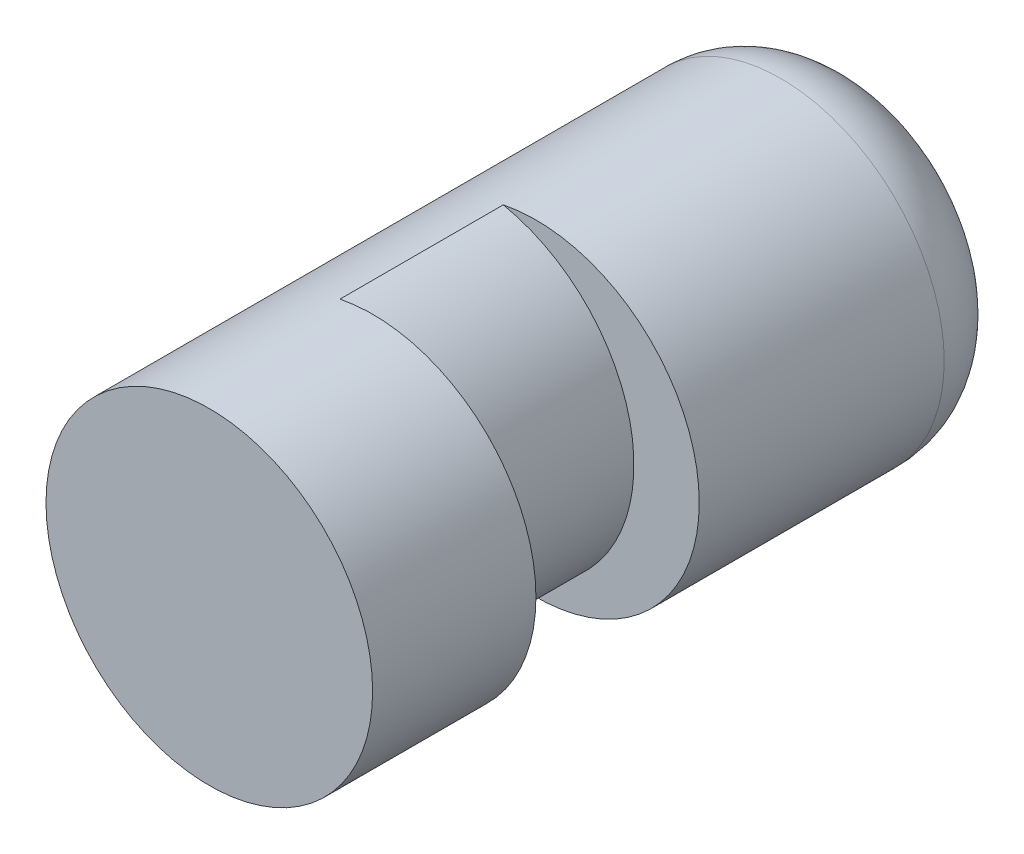
ISO-10303-21;
HEADER;
FILE_DESCRIPTION(('STEP AP214'),'2;1');
FILE_NAME('part.step','',(''),(''),'','','');
FILE_SCHEMA(('AUTOMOTIVE_DESIGN { 1 0 10303 214 1 1 1 1 }'));
ENDSEC;
DATA;
#1=APPLICATION_CONTEXT('core data for automotive mechanical design processes');
#2=APPLICATION_PROTOCOL_DEFINITION('international standard','automotive_design',2000,#1);
#3=PRODUCT_CONTEXT('',#1,'mechanical');
#4=PRODUCT('Part','Part','',(#3));
#5=PRODUCT_RELATED_PRODUCT_CATEGORY('part','',(#4));
#6=PRODUCT_DEFINITION_FORMATION('','',#4);
#7=PRODUCT_DEFINITION_CONTEXT('part definition',#1,'design');
#8=PRODUCT_DEFINITION('design','',#6,#7);
#9=PRODUCT_DEFINITION_SHAPE('','',#8);
#10=(LENGTH_UNIT() NAMED_UNIT(*) SI_UNIT(.MILLI.,.METRE.));
#11=(NAMED_UNIT(*) PLANE_ANGLE_UNIT() SI_UNIT($,.RADIAN.));
#12=(NAMED_UNIT(*) SI_UNIT($,.STERADIAN.) SOLID_ANGLE_UNIT());
#13=UNCERTAINTY_MEASURE_WITH_UNIT(LENGTH_MEASURE(1.E-05),#10,'distance_accuracy_value','');
#14=(GEOMETRIC_REPRESENTATION_CONTEXT(3) GLOBAL_UNCERTAINTY_ASSIGNED_CONTEXT((#13)) GLOBAL_UNIT_ASSIGNED_CONTEXT((#10,
#11,#12)) REPRESENTATION_CONTEXT('',''));
#15=CARTESIAN_POINT('',(0.,0.,0.));
#16=DIRECTION('',(0.,0.,1.));
#17=DIRECTION('',(1.,0.,0.));
#18=AXIS2_PLACEMENT_3D('',#15,#16,#17);
#19=CARTESIAN_POINT('',(-109.908874461109,962.175000000001,-25.4));
#20=DIRECTION('',(0.,0.,1.));
#21=DIRECTION('',(1.,0.,0.));
#22=AXIS2_PLACEMENT_3D('',#19,#20,#21);
#23=CYLINDRICAL_SURFACE('',#22,6.35000000000006);
#24=CARTESIAN_POINT('',(-109.908874461109,962.175000000001,-22.225));
#25=DIRECTION('',(0.,0.,1.));
#26=DIRECTION('',(1.,0.,0.));
#27=AXIS2_PLACEMENT_3D('',#24,#25,#26);
#28=CIRCLE('',#27,6.35000000000006);
#29=CARTESIAN_POINT('',(-103.558874461109,962.175000000001,-22.225));
#30=VERTEX_POINT('',#29);
#31=EDGE_CURVE('E41',#30,#30,#28,.T.);
#32=ORIENTED_EDGE('',*,*,#31,.T.);
#33=EDGE_LOOP('',(#32));
#34=FACE_BOUND('',#33,.T.);
#35=CARTESIAN_POINT('',(-109.908874461109,962.175000000001,-12.7));
#36=DIRECTION('',(0.,0.,-1.));
#37=DIRECTION('',(-1.,0.,0.));
#38=AXIS2_PLACEMENT_3D('',#35,#36,#37);
#39=CIRCLE('',#38,6.35000000000005);
#40=CARTESIAN_POINT('',(-111.178874461109,968.39670394667,-12.7));
#41=VERTEX_POINT('',#40);
#42=CARTESIAN_POINT('',(-111.178874461109,955.953296053332,-12.7));
#43=VERTEX_POINT('',#42);
#44=EDGE_CURVE('E66',#41,#43,#39,.T.);
#45=ORIENTED_EDGE('',*,*,#44,.T.);
#46=DIRECTION('',(0.,0.,1.));
#47=VECTOR('',#46,1.);
#48=CARTESIAN_POINT('',(-111.178874461109,955.953296053332,-12.7));
#49=LINE('',#48,#47);
#50=CARTESIAN_POINT('',(-111.178874461109,955.953296053332,-6.35000000000002));
#51=VERTEX_POINT('',#50);
#52=EDGE_CURVE('E62',#43,#51,#49,.T.);
#53=ORIENTED_EDGE('',*,*,#52,.T.);
#54=CARTESIAN_POINT('',(-109.908874461109,962.175000000001,-6.35000000000002));
#55=DIRECTION('',(0.,0.,-1.));
#56=DIRECTION('',(-1.,0.,0.));
#57=AXIS2_PLACEMENT_3D('',#54,#55,#56);
#58=CIRCLE('',#57,6.35000000000005);
#59=CARTESIAN_POINT('',(-111.178874461109,968.39670394667,-6.35000000000002));
#60=VERTEX_POINT('',#59);
#61=EDGE_CURVE('E67',#60,#51,#58,.T.);
#62=ORIENTED_EDGE('',*,*,#61,.F.);
#63=DIRECTION('',(0.,0.,1.));
#64=VECTOR('',#63,1.);
#65=CARTESIAN_POINT('',(-111.178874461109,968.39670394667,-12.7));
#66=LINE('',#65,#64);
#67=EDGE_CURVE('E48',#41,#60,#66,.T.);
#68=ORIENTED_EDGE('',*,*,#67,.F.);
#69=EDGE_LOOP('',(#45,#53,#62,#68));
#70=FACE_BOUND('',#69,.T.);
#71=CARTESIAN_POINT('',(-109.908874461109,962.175000000001,0.));
#72=DIRECTION('',(0.,0.,1.));
#73=DIRECTION('',(1.,0.,0.));
#74=AXIS2_PLACEMENT_3D('',#71,#72,#73);
#75=CIRCLE('',#74,6.35000000000006);
#76=CARTESIAN_POINT('',(-103.558874461109,962.175000000001,0.));
#77=VERTEX_POINT('',#76);
#78=EDGE_CURVE('E73',#77,#77,#75,.T.);
#79=ORIENTED_EDGE('',*,*,#78,.F.);
#80=EDGE_LOOP('',(#79));
#81=FACE_BOUND('',#80,.T.);
#82=ADVANCED_FACE('F33',(#34,#70,#81),#23,.T.);
#83=CARTESIAN_POINT('',(-109.908874461109,962.175000000001,-25.4));
#84=DIRECTION('',(0.,0.,1.));
#85=DIRECTION('',(1.,0.,0.));
#86=AXIS2_PLACEMENT_3D('',#83,#84,#85);
#87=PLANE('',#86);
#88=CARTESIAN_POINT('',(-109.908874461109,962.175000000001,-25.4));
#89=DIRECTION('',(0.,0.,1.));
#90=DIRECTION('',(1.,0.,0.));
#91=AXIS2_PLACEMENT_3D('',#88,#89,#90);
#92=CIRCLE('',#91,3.17500000000006);
#93=CARTESIAN_POINT('',(-106.733874461109,962.175000000001,-25.4));
#94=VERTEX_POINT('',#93);
#95=EDGE_CURVE('E11',#94,#94,#92,.F.);
#96=ORIENTED_EDGE('',*,*,#95,.T.);
#97=EDGE_LOOP('',(#96));
#98=FACE_BOUND('',#97,.T.);
#99=ADVANCED_FACE('F91',(#98),#87,.F.);
#100=CARTESIAN_POINT('',(-109.908874461109,962.175000000001,0.));
#101=DIRECTION('',(0.,0.,1.));
#102=DIRECTION('',(1.,0.,0.));
#103=AXIS2_PLACEMENT_3D('',#100,#101,#102);
#104=PLANE('',#103);
#105=ORIENTED_EDGE('',*,*,#78,.T.);
#106=EDGE_LOOP('',(#105));
#107=FACE_BOUND('',#106,.T.);
#108=ADVANCED_FACE('F95',(#107),#104,.T.);
#109=CARTESIAN_POINT('',(-112.448874461109,962.175000000001,-12.7));
#110=DIRECTION('',(0.,0.,1.));
#111=DIRECTION('',(1.,0.,0.));
#112=AXIS2_PLACEMENT_3D('',#109,#110,#111);
#113=CYLINDRICAL_SURFACE('',#112,6.35000000000005);
#114=CARTESIAN_POINT('',(-112.448874461109,962.175000000001,-6.35000000000002));
#115=DIRECTION('',(0.,0.,1.));
#116=DIRECTION('',(-1.,0.,0.));
#117=AXIS2_PLACEMENT_3D('',#114,#115,#116);
#118=CIRCLE('',#117,6.35000000000005);
#119=EDGE_CURVE('E58',#51,#60,#118,.T.);
#120=ORIENTED_EDGE('',*,*,#119,.F.);
#121=ORIENTED_EDGE('',*,*,#52,.F.);
#122=CARTESIAN_POINT('',(-112.448874461109,962.175000000001,-12.7));
#123=DIRECTION('',(0.,0.,1.));
#124=DIRECTION('',(-1.,0.,0.));
#125=AXIS2_PLACEMENT_3D('',#122,#123,#124);
#126=CIRCLE('',#125,6.35000000000005);
#127=EDGE_CURVE('E54',#43,#41,#126,.T.);
#128=ORIENTED_EDGE('',*,*,#127,.T.);
#129=ORIENTED_EDGE('',*,*,#67,.T.);
#130=EDGE_LOOP('',(#120,#121,#128,#129));
#131=FACE_BOUND('',#130,.T.);
#132=ADVANCED_FACE('F60',(#131),#113,.T.);
#133=CARTESIAN_POINT('',(-111.178874461109,962.175000000001,-12.7));
#134=DIRECTION('',(0.,0.,-1.));
#135=DIRECTION('',(-1.,0.,0.));
#136=AXIS2_PLACEMENT_3D('',#133,#134,#135);
#137=PLANE('',#136);
#138=ORIENTED_EDGE('',*,*,#44,.F.);
#139=ORIENTED_EDGE('',*,*,#127,.F.);
#140=EDGE_LOOP('',(#138,#139));
#141=FACE_BOUND('',#140,.T.);
#142=ADVANCED_FACE('F87',(#141),#137,.F.);
#143=CARTESIAN_POINT('',(-111.178874461109,962.175000000001,-6.35000000000002));
#144=DIRECTION('',(0.,0.,-1.));
#145=DIRECTION('',(-1.,0.,0.));
#146=AXIS2_PLACEMENT_3D('',#143,#144,#145);
#147=PLANE('',#146);
#148=ORIENTED_EDGE('',*,*,#61,.T.);
#149=ORIENTED_EDGE('',*,*,#119,.T.);
#150=EDGE_LOOP('',(#148,#149));
#151=FACE_BOUND('',#150,.T.);
#152=ADVANCED_FACE('F69',(#151),#147,.T.);
#153=CARTESIAN_POINT('',(-109.908874461109,962.175000000001,-22.225));
#154=DIRECTION('',(0.,0.,1.));
#155=DIRECTION('',(1.,0.,0.));
#156=AXIS2_PLACEMENT_3D('',#153,#154,#155);
#157=TOROIDAL_SURFACE('',#156,3.17500000000006,3.175);
#158=ORIENTED_EDGE('',*,*,#95,.F.);
#159=EDGE_LOOP('',(#158));
#160=FACE_BOUND('',#159,.T.);
#161=ORIENTED_EDGE('',*,*,#31,.F.);
#162=EDGE_LOOP('',(#161));
#163=FACE_BOUND('',#162,.T.);
#164=ADVANCED_FACE('F35',(#160,#163),#157,.T.);
#165=CLOSED_SHELL('',(#82,#99,#108,#132,#142,#152,#164));
#166=MANIFOLD_SOLID_BREP('B2',#165);
#167=ADVANCED_BREP_SHAPE_REPRESENTATION('',(#18,#166),#14);
#168=SHAPE_DEFINITION_REPRESENTATION(#9,#167);
ENDSEC;
END-ISO-10303-21;
